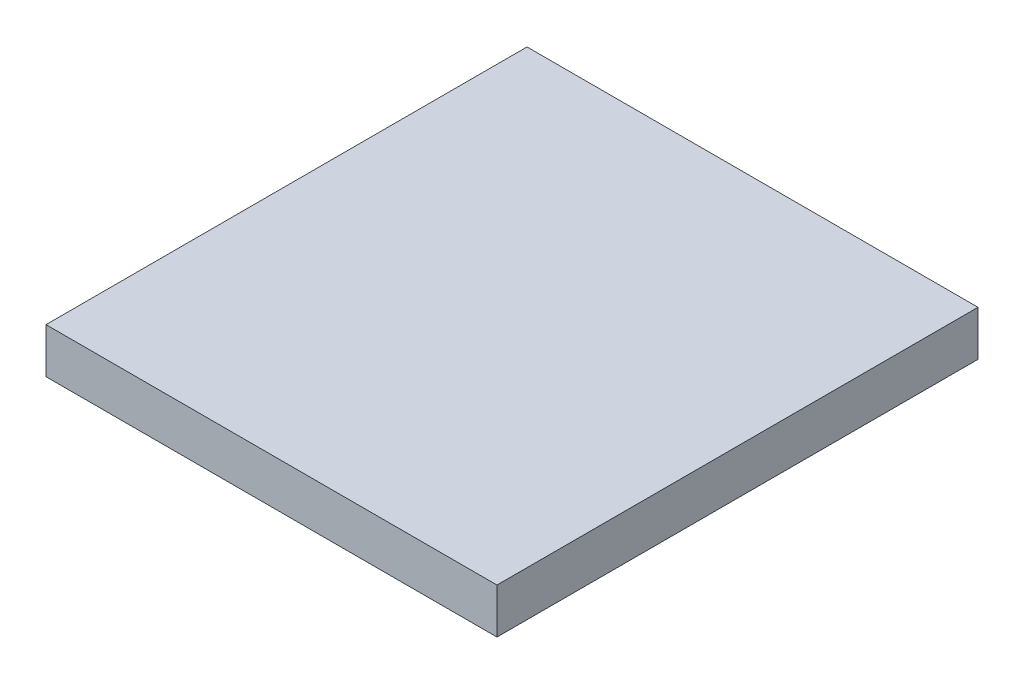
ISO-10303-21;
HEADER;
FILE_DESCRIPTION(('STEP AP214'),'2;1');
FILE_NAME('part.step','',(''),(''),'','','');
FILE_SCHEMA(('AUTOMOTIVE_DESIGN { 1 0 10303 214 1 1 1 1 }'));
ENDSEC;
DATA;
#1=APPLICATION_CONTEXT('core data for automotive mechanical design processes');
#2=APPLICATION_PROTOCOL_DEFINITION('international standard','automotive_design',2000,#1);
#3=PRODUCT_CONTEXT('',#1,'mechanical');
#4=PRODUCT('Part','Part','',(#3));
#5=PRODUCT_RELATED_PRODUCT_CATEGORY('part','',(#4));
#6=PRODUCT_DEFINITION_FORMATION('','',#4);
#7=PRODUCT_DEFINITION_CONTEXT('part definition',#1,'design');
#8=PRODUCT_DEFINITION('design','',#6,#7);
#9=PRODUCT_DEFINITION_SHAPE('','',#8);
#10=(LENGTH_UNIT() NAMED_UNIT(*) SI_UNIT(.MILLI.,.METRE.));
#11=(NAMED_UNIT(*) PLANE_ANGLE_UNIT() SI_UNIT($,.RADIAN.));
#12=(NAMED_UNIT(*) SI_UNIT($,.STERADIAN.) SOLID_ANGLE_UNIT());
#13=UNCERTAINTY_MEASURE_WITH_UNIT(LENGTH_MEASURE(1.E-05),#10,'distance_accuracy_value','');
#14=(GEOMETRIC_REPRESENTATION_CONTEXT(3) GLOBAL_UNCERTAINTY_ASSIGNED_CONTEXT((#13)) GLOBAL_UNIT_ASSIGNED_CONTEXT((#10,
#11,#12)) REPRESENTATION_CONTEXT('',''));
#15=CARTESIAN_POINT('',(0.,0.,0.));
#16=DIRECTION('',(0.,0.,1.));
#17=DIRECTION('',(1.,0.,0.));
#18=AXIS2_PLACEMENT_3D('',#15,#16,#17);
#19=CARTESIAN_POINT('',(-45.,4.5,-48.));
#20=DIRECTION('',(1.,0.,0.));
#21=DIRECTION('',(0.,0.,-1.));
#22=AXIS2_PLACEMENT_3D('',#19,#20,#21);
#23=PLANE('',#22);
#24=DIRECTION('',(0.,0.,1.));
#25=VECTOR('',#24,1.);
#26=CARTESIAN_POINT('',(-45.,-4.5,-48.));
#27=LINE('',#26,#25);
#28=CARTESIAN_POINT('',(-45.,-4.5,-48.));
#29=VERTEX_POINT('',#28);
#30=CARTESIAN_POINT('',(-45.,-4.5,48.));
#31=VERTEX_POINT('',#30);
#32=EDGE_CURVE('E117',#29,#31,#27,.T.);
#33=ORIENTED_EDGE('',*,*,#32,.T.);
#34=DIRECTION('',(0.,-1.,0.));
#35=VECTOR('',#34,1.);
#36=CARTESIAN_POINT('',(-45.,4.5,48.));
#37=LINE('',#36,#35);
#38=CARTESIAN_POINT('',(-45.,4.5,48.));
#39=VERTEX_POINT('',#38);
#40=EDGE_CURVE('E11',#39,#31,#37,.T.);
#41=ORIENTED_EDGE('',*,*,#40,.F.);
#42=DIRECTION('',(0.,0.,1.));
#43=VECTOR('',#42,1.);
#44=CARTESIAN_POINT('',(-45.,4.5,-48.));
#45=LINE('',#44,#43);
#46=CARTESIAN_POINT('',(-45.,4.5,-48.));
#47=VERTEX_POINT('',#46);
#48=EDGE_CURVE('E101',#47,#39,#45,.T.);
#49=ORIENTED_EDGE('',*,*,#48,.F.);
#50=DIRECTION('',(0.,-1.,0.));
#51=VECTOR('',#50,1.);
#52=CARTESIAN_POINT('',(-45.,4.5,-48.));
#53=LINE('',#52,#51);
#54=EDGE_CURVE('E113',#47,#29,#53,.T.);
#55=ORIENTED_EDGE('',*,*,#54,.T.);
#56=EDGE_LOOP('',(#33,#41,#49,#55));
#57=FACE_BOUND('',#56,.T.);
#58=ADVANCED_FACE('F49',(#57),#23,.F.);
#59=CARTESIAN_POINT('',(-45.,4.5,48.));
#60=DIRECTION('',(0.,0.,-1.));
#61=DIRECTION('',(-1.,0.,0.));
#62=AXIS2_PLACEMENT_3D('',#59,#60,#61);
#63=PLANE('',#62);
#64=DIRECTION('',(1.,0.,0.));
#65=VECTOR('',#64,1.);
#66=CARTESIAN_POINT('',(-45.,-4.5,48.));
#67=LINE('',#66,#65);
#68=CARTESIAN_POINT('',(45.,-4.5,48.));
#69=VERTEX_POINT('',#68);
#70=EDGE_CURVE('E106',#31,#69,#67,.T.);
#71=ORIENTED_EDGE('',*,*,#70,.T.);
#72=DIRECTION('',(0.,-1.,0.));
#73=VECTOR('',#72,1.);
#74=CARTESIAN_POINT('',(45.,4.5,48.));
#75=LINE('',#74,#73);
#76=CARTESIAN_POINT('',(45.,4.5,48.));
#77=VERTEX_POINT('',#76);
#78=EDGE_CURVE('E58',#77,#69,#75,.T.);
#79=ORIENTED_EDGE('',*,*,#78,.F.);
#80=DIRECTION('',(1.,0.,0.));
#81=VECTOR('',#80,1.);
#82=CARTESIAN_POINT('',(-45.,4.5,48.));
#83=LINE('',#82,#81);
#84=EDGE_CURVE('E96',#39,#77,#83,.T.);
#85=ORIENTED_EDGE('',*,*,#84,.F.);
#86=ORIENTED_EDGE('',*,*,#40,.T.);
#87=EDGE_LOOP('',(#71,#79,#85,#86));
#88=FACE_BOUND('',#87,.T.);
#89=ADVANCED_FACE('F105',(#88),#63,.F.);
#90=CARTESIAN_POINT('',(45.,4.5,-48.));
#91=DIRECTION('',(-1.,0.,0.));
#92=DIRECTION('',(0.,0.,1.));
#93=AXIS2_PLACEMENT_3D('',#90,#91,#92);
#94=PLANE('',#93);
#95=DIRECTION('',(0.,0.,-1.));
#96=VECTOR('',#95,1.);
#97=CARTESIAN_POINT('',(45.,-4.5,-48.));
#98=LINE('',#97,#96);
#99=CARTESIAN_POINT('',(45.,-4.5,-48.));
#100=VERTEX_POINT('',#99);
#101=EDGE_CURVE('E83',#69,#100,#98,.T.);
#102=ORIENTED_EDGE('',*,*,#101,.T.);
#103=DIRECTION('',(0.,-1.,0.));
#104=VECTOR('',#103,1.);
#105=CARTESIAN_POINT('',(45.,4.5,-48.));
#106=LINE('',#105,#104);
#107=CARTESIAN_POINT('',(45.,4.5,-48.));
#108=VERTEX_POINT('',#107);
#109=EDGE_CURVE('E108',#108,#100,#106,.T.);
#110=ORIENTED_EDGE('',*,*,#109,.F.);
#111=DIRECTION('',(0.,0.,-1.));
#112=VECTOR('',#111,1.);
#113=CARTESIAN_POINT('',(45.,4.5,-48.));
#114=LINE('',#113,#112);
#115=EDGE_CURVE('E99',#77,#108,#114,.T.);
#116=ORIENTED_EDGE('',*,*,#115,.F.);
#117=ORIENTED_EDGE('',*,*,#78,.T.);
#118=EDGE_LOOP('',(#102,#110,#116,#117));
#119=FACE_BOUND('',#118,.T.);
#120=ADVANCED_FACE('F109',(#119),#94,.F.);
#121=CARTESIAN_POINT('',(-45.,4.5,-48.));
#122=DIRECTION('',(0.,0.,1.));
#123=DIRECTION('',(1.,0.,0.));
#124=AXIS2_PLACEMENT_3D('',#121,#122,#123);
#125=PLANE('',#124);
#126=DIRECTION('',(-1.,0.,0.));
#127=VECTOR('',#126,1.);
#128=CARTESIAN_POINT('',(-45.,-4.5,-48.));
#129=LINE('',#128,#127);
#130=EDGE_CURVE('E89',#100,#29,#129,.T.);
#131=ORIENTED_EDGE('',*,*,#130,.T.);
#132=ORIENTED_EDGE('',*,*,#54,.F.);
#133=DIRECTION('',(-1.,0.,0.));
#134=VECTOR('',#133,1.);
#135=CARTESIAN_POINT('',(-45.,4.5,-48.));
#136=LINE('',#135,#134);
#137=EDGE_CURVE('E66',#108,#47,#136,.T.);
#138=ORIENTED_EDGE('',*,*,#137,.F.);
#139=ORIENTED_EDGE('',*,*,#109,.T.);
#140=EDGE_LOOP('',(#131,#132,#138,#139));
#141=FACE_BOUND('',#140,.T.);
#142=ADVANCED_FACE('F130',(#141),#125,.F.);
#143=CARTESIAN_POINT('',(0.,4.5,0.));
#144=DIRECTION('',(0.,1.,0.));
#145=DIRECTION('',(0.,0.,1.));
#146=AXIS2_PLACEMENT_3D('',#143,#144,#145);
#147=PLANE('',#146);
#148=ORIENTED_EDGE('',*,*,#48,.T.);
#149=ORIENTED_EDGE('',*,*,#84,.T.);
#150=ORIENTED_EDGE('',*,*,#115,.T.);
#151=ORIENTED_EDGE('',*,*,#137,.T.);
#152=EDGE_LOOP('',(#148,#149,#150,#151));
#153=FACE_BOUND('',#152,.T.);
#154=ADVANCED_FACE('F97',(#153),#147,.T.);
#155=CARTESIAN_POINT('',(0.,-4.5,0.));
#156=DIRECTION('',(0.,1.,0.));
#157=DIRECTION('',(0.,0.,1.));
#158=AXIS2_PLACEMENT_3D('',#155,#156,#157);
#159=PLANE('',#158);
#160=ORIENTED_EDGE('',*,*,#32,.F.);
#161=ORIENTED_EDGE('',*,*,#130,.F.);
#162=ORIENTED_EDGE('',*,*,#101,.F.);
#163=ORIENTED_EDGE('',*,*,#70,.F.);
#164=EDGE_LOOP('',(#160,#161,#162,#163));
#165=FACE_BOUND('',#164,.T.);
#166=ADVANCED_FACE('F133',(#165),#159,.F.);
#167=CLOSED_SHELL('',(#58,#89,#120,#142,#154,#166));
#168=MANIFOLD_SOLID_BREP('B2',#167);
#169=ADVANCED_BREP_SHAPE_REPRESENTATION('',(#18,#168),#14);
#170=SHAPE_DEFINITION_REPRESENTATION(#9,#169);
ENDSEC;
END-ISO-10303-21;
